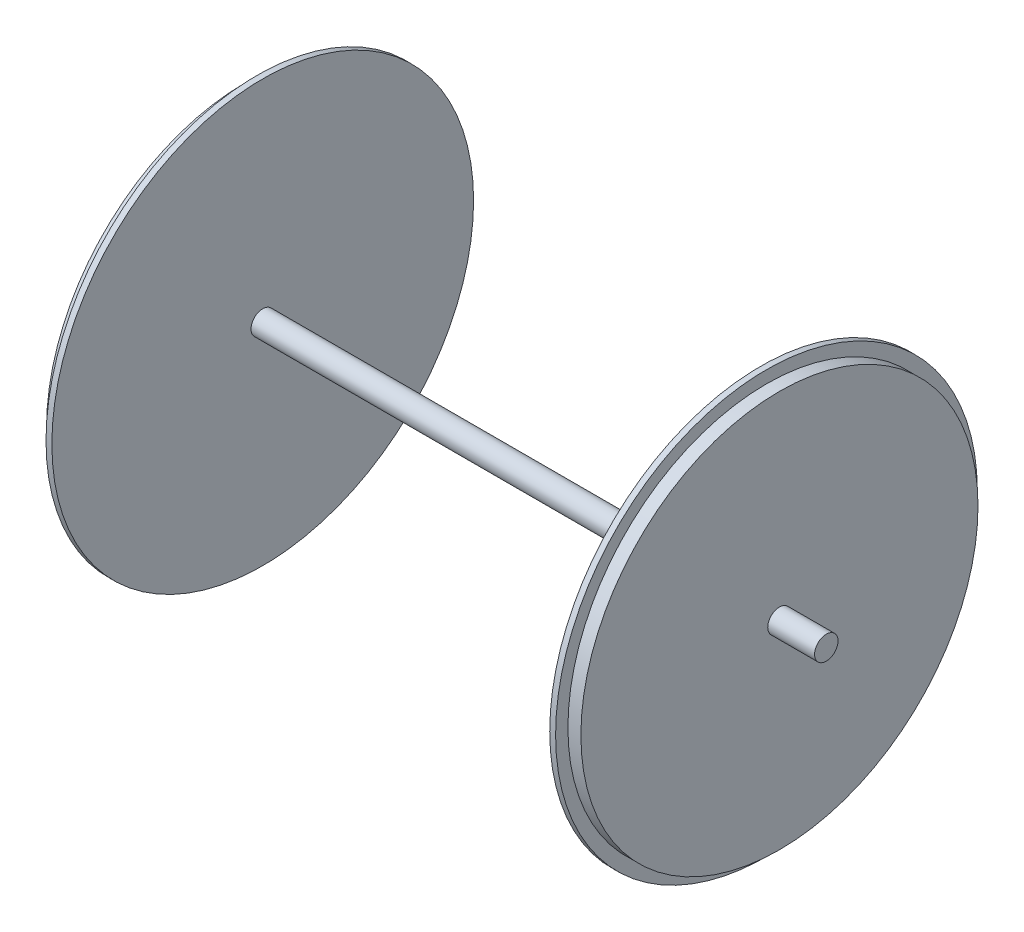
ISO-10303-21;
HEADER;
FILE_DESCRIPTION(('STEP AP214'),'2;1');
FILE_NAME('part.step','',(''),(''),'','','');
FILE_SCHEMA(('AUTOMOTIVE_DESIGN { 1 0 10303 214 1 1 1 1 }'));
ENDSEC;
DATA;
#1=APPLICATION_CONTEXT('core data for automotive mechanical design processes');
#2=APPLICATION_PROTOCOL_DEFINITION('international standard','automotive_design',2000,#1);
#3=PRODUCT_CONTEXT('',#1,'mechanical');
#4=PRODUCT('Part','Part','',(#3));
#5=PRODUCT_RELATED_PRODUCT_CATEGORY('part','',(#4));
#6=PRODUCT_DEFINITION_FORMATION('','',#4);
#7=PRODUCT_DEFINITION_CONTEXT('part definition',#1,'design');
#8=PRODUCT_DEFINITION('design','',#6,#7);
#9=PRODUCT_DEFINITION_SHAPE('','',#8);
#10=(LENGTH_UNIT() NAMED_UNIT(*) SI_UNIT(.MILLI.,.METRE.));
#11=(NAMED_UNIT(*) PLANE_ANGLE_UNIT() SI_UNIT($,.RADIAN.));
#12=(NAMED_UNIT(*) SI_UNIT($,.STERADIAN.) SOLID_ANGLE_UNIT());
#13=UNCERTAINTY_MEASURE_WITH_UNIT(LENGTH_MEASURE(1.E-05),#10,'distance_accuracy_value','');
#14=(GEOMETRIC_REPRESENTATION_CONTEXT(3) GLOBAL_UNCERTAINTY_ASSIGNED_CONTEXT((#13)) GLOBAL_UNIT_ASSIGNED_CONTEXT((#10,
#11,#12)) REPRESENTATION_CONTEXT('',''));
#15=CARTESIAN_POINT('',(0.,0.,0.));
#16=DIRECTION('',(0.,0.,1.));
#17=DIRECTION('',(1.,0.,0.));
#18=AXIS2_PLACEMENT_3D('',#15,#16,#17);
#19=CARTESIAN_POINT('',(-533.400000000001,0.,0.));
#20=DIRECTION('',(-1.,0.,0.));
#21=DIRECTION('',(0.,0.,1.));
#22=AXIS2_PLACEMENT_3D('',#19,#20,#21);
#23=PLANE('',#22);
#24=CARTESIAN_POINT('',(-533.400000000001,0.,0.));
#25=DIRECTION('',(-1.,0.,0.));
#26=DIRECTION('',(0.,0.,1.));
#27=AXIS2_PLACEMENT_3D('',#24,#25,#26);
#28=CIRCLE('',#27,50.8000000000007);
#29=CARTESIAN_POINT('',(-533.400000000001,0.,50.8000000000007));
#30=VERTEX_POINT('',#29);
#31=EDGE_CURVE('E10',#30,#30,#28,.T.);
#32=ORIENTED_EDGE('',*,*,#31,.F.);
#33=EDGE_LOOP('',(#32));
#34=FACE_BOUND('',#33,.T.);
#35=ADVANCED_FACE('F31',(#34),#23,.F.);
#36=CARTESIAN_POINT('',(-3053.51541714591,0.,0.));
#37=DIRECTION('',(-1.,0.,0.));
#38=DIRECTION('',(0.,0.,1.));
#39=AXIS2_PLACEMENT_3D('',#36,#37,#38);
#40=CYLINDRICAL_SURFACE('',#39,50.8000000000007);
#41=CARTESIAN_POINT('',(-736.600000000001,0.,0.));
#42=DIRECTION('',(-1.,0.,0.));
#43=DIRECTION('',(0.,0.,1.));
#44=AXIS2_PLACEMENT_3D('',#41,#42,#43);
#45=CIRCLE('',#44,50.8000000000007);
#46=CARTESIAN_POINT('',(-736.600000000001,0.,50.8000000000007));
#47=VERTEX_POINT('',#46);
#48=EDGE_CURVE('E37',#47,#47,#45,.T.);
#49=ORIENTED_EDGE('',*,*,#48,.F.);
#50=EDGE_LOOP('',(#49));
#51=FACE_BOUND('',#50,.T.);
#52=ORIENTED_EDGE('',*,*,#31,.T.);
#53=EDGE_LOOP('',(#52));
#54=FACE_BOUND('',#53,.T.);
#55=ADVANCED_FACE('F151',(#51,#54),#40,.T.);
#56=CARTESIAN_POINT('',(-736.600000000001,50.8000000000007,0.));
#57=DIRECTION('',(-1.,0.,0.));
#58=DIRECTION('',(0.,0.,1.));
#59=AXIS2_PLACEMENT_3D('',#56,#57,#58);
#60=PLANE('',#59);
#61=CARTESIAN_POINT('',(-736.600000000001,0.,0.));
#62=DIRECTION('',(-1.,0.,0.));
#63=DIRECTION('',(0.,0.,1.));
#64=AXIS2_PLACEMENT_3D('',#61,#62,#63);
#65=CIRCLE('',#64,861.011549076579);
#66=CARTESIAN_POINT('',(-736.600000000001,0.,861.011549076579));
#67=VERTEX_POINT('',#66);
#68=EDGE_CURVE('E41',#67,#67,#65,.T.);
#69=ORIENTED_EDGE('',*,*,#68,.F.);
#70=EDGE_LOOP('',(#69));
#71=FACE_BOUND('',#70,.T.);
#72=ORIENTED_EDGE('',*,*,#48,.T.);
#73=EDGE_LOOP('',(#72));
#74=FACE_BOUND('',#73,.T.);
#75=ADVANCED_FACE('F146',(#71,#74),#60,.F.);
#76=CARTESIAN_POINT('',(-3053.51541714591,0.,0.));
#77=DIRECTION('',(-1.,0.,0.));
#78=DIRECTION('',(0.,0.,1.));
#79=AXIS2_PLACEMENT_3D('',#76,#77,#78);
#80=CYLINDRICAL_SURFACE('',#79,861.011549076579);
#81=CARTESIAN_POINT('',(-792.91541714591,0.,0.));
#82=DIRECTION('',(-1.,0.,0.));
#83=DIRECTION('',(0.,0.,1.));
#84=AXIS2_PLACEMENT_3D('',#81,#82,#83);
#85=CIRCLE('',#84,861.01154907658);
#86=CARTESIAN_POINT('',(-792.91541714591,0.,861.01154907658));
#87=VERTEX_POINT('',#86);
#88=EDGE_CURVE('E45',#87,#87,#85,.T.);
#89=ORIENTED_EDGE('',*,*,#88,.F.);
#90=EDGE_LOOP('',(#89));
#91=FACE_BOUND('',#90,.T.);
#92=ORIENTED_EDGE('',*,*,#68,.T.);
#93=EDGE_LOOP('',(#92));
#94=FACE_BOUND('',#93,.T.);
#95=ADVANCED_FACE('F140',(#91,#94),#80,.T.);
#96=CARTESIAN_POINT('',(-792.91541714591,861.01154907658,0.));
#97=DIRECTION('',(-1.,0.,0.));
#98=DIRECTION('',(0.,0.,1.));
#99=AXIS2_PLACEMENT_3D('',#96,#97,#98);
#100=PLANE('',#99);
#101=CARTESIAN_POINT('',(-792.91541714591,0.,0.));
#102=DIRECTION('',(-1.,0.,0.));
#103=DIRECTION('',(0.,0.,1.));
#104=AXIS2_PLACEMENT_3D('',#101,#102,#103);
#105=CIRCLE('',#104,914.400000000001);
#106=CARTESIAN_POINT('',(-792.91541714591,0.,914.400000000001));
#107=VERTEX_POINT('',#106);
#108=EDGE_CURVE('E50',#107,#107,#105,.T.);
#109=ORIENTED_EDGE('',*,*,#108,.F.);
#110=EDGE_LOOP('',(#109));
#111=FACE_BOUND('',#110,.T.);
#112=ORIENTED_EDGE('',*,*,#88,.T.);
#113=EDGE_LOOP('',(#112));
#114=FACE_BOUND('',#113,.T.);
#115=ADVANCED_FACE('F134',(#111,#114),#100,.F.);
#116=CARTESIAN_POINT('',(-3053.51541714591,0.,0.));
#117=DIRECTION('',(-1.,0.,0.));
#118=DIRECTION('',(0.,0.,1.));
#119=AXIS2_PLACEMENT_3D('',#116,#117,#118);
#120=CYLINDRICAL_SURFACE('',#119,914.400000000001);
#121=CARTESIAN_POINT('',(-818.31541714591,0.,0.));
#122=DIRECTION('',(-1.,0.,0.));
#123=DIRECTION('',(0.,0.,1.));
#124=AXIS2_PLACEMENT_3D('',#121,#122,#123);
#125=CIRCLE('',#124,914.400000000001);
#126=CARTESIAN_POINT('',(-818.31541714591,0.,914.400000000001));
#127=VERTEX_POINT('',#126);
#128=EDGE_CURVE('E53',#127,#127,#125,.T.);
#129=ORIENTED_EDGE('',*,*,#128,.F.);
#130=EDGE_LOOP('',(#129));
#131=FACE_BOUND('',#130,.T.);
#132=ORIENTED_EDGE('',*,*,#108,.T.);
#133=EDGE_LOOP('',(#132));
#134=FACE_BOUND('',#133,.T.);
#135=ADVANCED_FACE('F128',(#131,#134),#120,.T.);
#136=CARTESIAN_POINT('',(-818.31541714591,914.400000000001,0.));
#137=DIRECTION('',(1.,0.,0.));
#138=DIRECTION('',(0.,0.,-1.));
#139=AXIS2_PLACEMENT_3D('',#136,#137,#138);
#140=PLANE('',#139);
#141=CARTESIAN_POINT('',(-818.31541714591,0.,0.));
#142=DIRECTION('',(-1.,0.,0.));
#143=DIRECTION('',(0.,0.,1.));
#144=AXIS2_PLACEMENT_3D('',#141,#142,#143);
#145=CIRCLE('',#144,50.8000000000007);
#146=CARTESIAN_POINT('',(-818.31541714591,0.,50.8000000000007));
#147=VERTEX_POINT('',#146);
#148=EDGE_CURVE('E56',#147,#147,#145,.T.);
#149=ORIENTED_EDGE('',*,*,#148,.F.);
#150=EDGE_LOOP('',(#149));
#151=FACE_BOUND('',#150,.T.);
#152=ORIENTED_EDGE('',*,*,#128,.T.);
#153=EDGE_LOOP('',(#152));
#154=FACE_BOUND('',#153,.T.);
#155=ADVANCED_FACE('F122',(#151,#154),#140,.F.);
#156=CARTESIAN_POINT('',(-3053.51541714591,0.,0.));
#157=DIRECTION('',(-1.,0.,0.));
#158=DIRECTION('',(0.,0.,1.));
#159=AXIS2_PLACEMENT_3D('',#156,#157,#158);
#160=CYLINDRICAL_SURFACE('',#159,50.8000000000007);
#161=CARTESIAN_POINT('',(-2977.31541714591,0.,0.));
#162=DIRECTION('',(-1.,0.,0.));
#163=DIRECTION('',(0.,0.,1.));
#164=AXIS2_PLACEMENT_3D('',#161,#162,#163);
#165=CIRCLE('',#164,50.8000000000007);
#166=CARTESIAN_POINT('',(-2977.31541714591,0.,50.8000000000007));
#167=VERTEX_POINT('',#166);
#168=EDGE_CURVE('E59',#167,#167,#165,.T.);
#169=ORIENTED_EDGE('',*,*,#168,.F.);
#170=EDGE_LOOP('',(#169));
#171=FACE_BOUND('',#170,.T.);
#172=ORIENTED_EDGE('',*,*,#148,.T.);
#173=EDGE_LOOP('',(#172));
#174=FACE_BOUND('',#173,.T.);
#175=ADVANCED_FACE('F116',(#171,#174),#160,.T.);
#176=CARTESIAN_POINT('',(-2977.31541714591,914.400000000001,0.));
#177=DIRECTION('',(-1.,0.,0.));
#178=DIRECTION('',(0.,0.,1.));
#179=AXIS2_PLACEMENT_3D('',#176,#177,#178);
#180=PLANE('',#179);
#181=CARTESIAN_POINT('',(-2977.31541714591,0.,0.));
#182=DIRECTION('',(-1.,0.,0.));
#183=DIRECTION('',(0.,0.,1.));
#184=AXIS2_PLACEMENT_3D('',#181,#182,#183);
#185=CIRCLE('',#184,914.400000000001);
#186=CARTESIAN_POINT('',(-2977.31541714591,0.,914.400000000001));
#187=VERTEX_POINT('',#186);
#188=EDGE_CURVE('E62',#187,#187,#185,.T.);
#189=ORIENTED_EDGE('',*,*,#188,.F.);
#190=EDGE_LOOP('',(#189));
#191=FACE_BOUND('',#190,.T.);
#192=ORIENTED_EDGE('',*,*,#168,.T.);
#193=EDGE_LOOP('',(#192));
#194=FACE_BOUND('',#193,.T.);
#195=ADVANCED_FACE('F110',(#191,#194),#180,.F.);
#196=CARTESIAN_POINT('',(-3053.51541714591,0.,0.));
#197=DIRECTION('',(-1.,0.,0.));
#198=DIRECTION('',(0.,0.,1.));
#199=AXIS2_PLACEMENT_3D('',#196,#197,#198);
#200=CYLINDRICAL_SURFACE('',#199,914.400000000001);
#201=CARTESIAN_POINT('',(-3002.71541714591,0.,0.));
#202=DIRECTION('',(-1.,0.,0.));
#203=DIRECTION('',(0.,0.,1.));
#204=AXIS2_PLACEMENT_3D('',#201,#202,#203);
#205=CIRCLE('',#204,914.400000000001);
#206=CARTESIAN_POINT('',(-3002.71541714591,0.,914.400000000001));
#207=VERTEX_POINT('',#206);
#208=EDGE_CURVE('E65',#207,#207,#205,.T.);
#209=ORIENTED_EDGE('',*,*,#208,.F.);
#210=EDGE_LOOP('',(#209));
#211=FACE_BOUND('',#210,.T.);
#212=ORIENTED_EDGE('',*,*,#188,.T.);
#213=EDGE_LOOP('',(#212));
#214=FACE_BOUND('',#213,.T.);
#215=ADVANCED_FACE('F104',(#211,#214),#200,.T.);
#216=CARTESIAN_POINT('',(-3002.71541714591,914.400000000001,0.));
#217=DIRECTION('',(1.,0.,0.));
#218=DIRECTION('',(0.,0.,-1.));
#219=AXIS2_PLACEMENT_3D('',#216,#217,#218);
#220=PLANE('',#219);
#221=CARTESIAN_POINT('',(-3002.71541714591,0.,0.));
#222=DIRECTION('',(-1.,0.,0.));
#223=DIRECTION('',(0.,0.,1.));
#224=AXIS2_PLACEMENT_3D('',#221,#222,#223);
#225=CIRCLE('',#224,861.011549076579);
#226=CARTESIAN_POINT('',(-3002.71541714591,0.,861.011549076579));
#227=VERTEX_POINT('',#226);
#228=EDGE_CURVE('E68',#227,#227,#225,.T.);
#229=ORIENTED_EDGE('',*,*,#228,.F.);
#230=EDGE_LOOP('',(#229));
#231=FACE_BOUND('',#230,.T.);
#232=ORIENTED_EDGE('',*,*,#208,.T.);
#233=EDGE_LOOP('',(#232));
#234=FACE_BOUND('',#233,.T.);
#235=ADVANCED_FACE('F98',(#231,#234),#220,.F.);
#236=CARTESIAN_POINT('',(-3053.51541714591,0.,0.));
#237=DIRECTION('',(-1.,0.,0.));
#238=DIRECTION('',(0.,0.,1.));
#239=AXIS2_PLACEMENT_3D('',#236,#237,#238);
#240=CYLINDRICAL_SURFACE('',#239,861.011549076579);
#241=CARTESIAN_POINT('',(-3053.51541714591,0.,0.));
#242=DIRECTION('',(-1.,0.,0.));
#243=DIRECTION('',(0.,0.,1.));
#244=AXIS2_PLACEMENT_3D('',#241,#242,#243);
#245=CIRCLE('',#244,861.011549076579);
#246=CARTESIAN_POINT('',(-3053.51541714591,0.,861.011549076579));
#247=VERTEX_POINT('',#246);
#248=EDGE_CURVE('E71',#247,#247,#245,.T.);
#249=ORIENTED_EDGE('',*,*,#248,.F.);
#250=EDGE_LOOP('',(#249));
#251=FACE_BOUND('',#250,.T.);
#252=ORIENTED_EDGE('',*,*,#228,.T.);
#253=EDGE_LOOP('',(#252));
#254=FACE_BOUND('',#253,.T.);
#255=ADVANCED_FACE('F92',(#251,#254),#240,.T.);
#256=CARTESIAN_POINT('',(-3053.51541714591,50.8000000000007,0.));
#257=DIRECTION('',(1.,0.,0.));
#258=DIRECTION('',(0.,0.,-1.));
#259=AXIS2_PLACEMENT_3D('',#256,#257,#258);
#260=PLANE('',#259);
#261=CARTESIAN_POINT('',(-3053.51541714591,0.,0.));
#262=DIRECTION('',(-1.,0.,0.));
#263=DIRECTION('',(0.,0.,1.));
#264=AXIS2_PLACEMENT_3D('',#261,#262,#263);
#265=CIRCLE('',#264,50.8000000000007);
#266=CARTESIAN_POINT('',(-3053.51541714591,0.,50.8000000000007));
#267=VERTEX_POINT('',#266);
#268=EDGE_CURVE('E74',#267,#267,#265,.T.);
#269=ORIENTED_EDGE('',*,*,#268,.F.);
#270=EDGE_LOOP('',(#269));
#271=FACE_BOUND('',#270,.T.);
#272=ORIENTED_EDGE('',*,*,#248,.T.);
#273=EDGE_LOOP('',(#272));
#274=FACE_BOUND('',#273,.T.);
#275=ADVANCED_FACE('F86',(#271,#274),#260,.F.);
#276=CARTESIAN_POINT('',(-3053.51541714591,0.,0.));
#277=DIRECTION('',(-1.,0.,0.));
#278=DIRECTION('',(0.,0.,1.));
#279=AXIS2_PLACEMENT_3D('',#276,#277,#278);
#280=CYLINDRICAL_SURFACE('',#279,50.8000000000007);
#281=CARTESIAN_POINT('',(-3256.71541714591,0.,0.));
#282=DIRECTION('',(-1.,0.,0.));
#283=DIRECTION('',(0.,0.,1.));
#284=AXIS2_PLACEMENT_3D('',#281,#282,#283);
#285=CIRCLE('',#284,50.8000000000007);
#286=CARTESIAN_POINT('',(-3256.71541714591,0.,50.8000000000007));
#287=VERTEX_POINT('',#286);
#288=EDGE_CURVE('E77',#287,#287,#285,.T.);
#289=ORIENTED_EDGE('',*,*,#288,.F.);
#290=EDGE_LOOP('',(#289));
#291=FACE_BOUND('',#290,.T.);
#292=ORIENTED_EDGE('',*,*,#268,.T.);
#293=EDGE_LOOP('',(#292));
#294=FACE_BOUND('',#293,.T.);
#295=ADVANCED_FACE('F83',(#291,#294),#280,.T.);
#296=CARTESIAN_POINT('',(-3256.71541714591,0.,0.));
#297=DIRECTION('',(1.,0.,0.));
#298=DIRECTION('',(0.,0.,-1.));
#299=AXIS2_PLACEMENT_3D('',#296,#297,#298);
#300=PLANE('',#299);
#301=ORIENTED_EDGE('',*,*,#288,.T.);
#302=EDGE_LOOP('',(#301));
#303=FACE_BOUND('',#302,.T.);
#304=ADVANCED_FACE('F81',(#303),#300,.F.);
#305=CLOSED_SHELL('',(#35,#55,#75,#95,#115,#135,#155,#175,#195,#215,#235,#255,#275,#295,#304));
#306=MANIFOLD_SOLID_BREP('B2',#305);
#307=ADVANCED_BREP_SHAPE_REPRESENTATION('',(#18,#306),#14);
#308=SHAPE_DEFINITION_REPRESENTATION(#9,#307);
ENDSEC;
END-ISO-10303-21;
